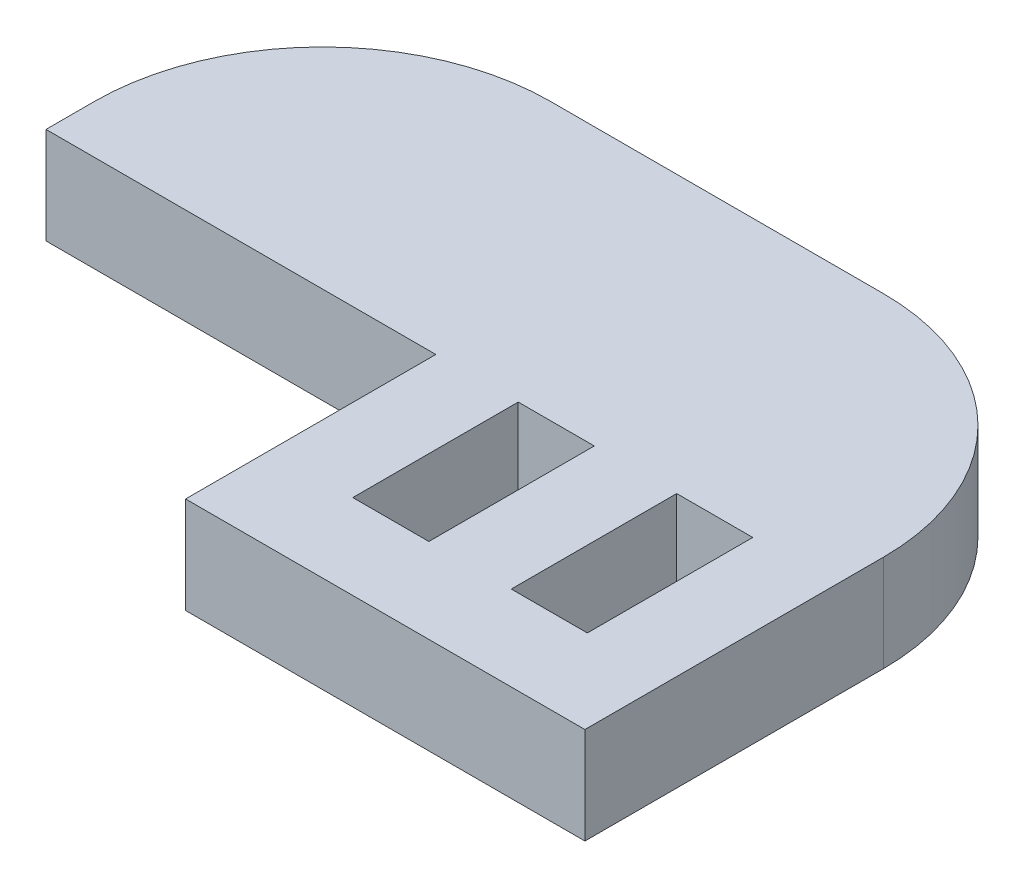
ISO-10303-21;
HEADER;
FILE_DESCRIPTION(('STEP AP214'),'2;1');
FILE_NAME('part.step','',(''),(''),'','','');
FILE_SCHEMA(('AUTOMOTIVE_DESIGN { 1 0 10303 214 1 1 1 1 }'));
ENDSEC;
DATA;
#1=APPLICATION_CONTEXT('core data for automotive mechanical design processes');
#2=APPLICATION_PROTOCOL_DEFINITION('international standard','automotive_design',2000,#1);
#3=PRODUCT_CONTEXT('',#1,'mechanical');
#4=PRODUCT('Part','Part','',(#3));
#5=PRODUCT_RELATED_PRODUCT_CATEGORY('part','',(#4));
#6=PRODUCT_DEFINITION_FORMATION('','',#4);
#7=PRODUCT_DEFINITION_CONTEXT('part definition',#1,'design');
#8=PRODUCT_DEFINITION('design','',#6,#7);
#9=PRODUCT_DEFINITION_SHAPE('','',#8);
#10=(LENGTH_UNIT() NAMED_UNIT(*) SI_UNIT(.MILLI.,.METRE.));
#11=(NAMED_UNIT(*) PLANE_ANGLE_UNIT() SI_UNIT($,.RADIAN.));
#12=(NAMED_UNIT(*) SI_UNIT($,.STERADIAN.) SOLID_ANGLE_UNIT());
#13=UNCERTAINTY_MEASURE_WITH_UNIT(LENGTH_MEASURE(1.E-05),#10,'distance_accuracy_value','');
#14=(GEOMETRIC_REPRESENTATION_CONTEXT(3) GLOBAL_UNCERTAINTY_ASSIGNED_CONTEXT((#13)) GLOBAL_UNIT_ASSIGNED_CONTEXT((#10,
#11,#12)) REPRESENTATION_CONTEXT('',''));
#15=CARTESIAN_POINT('',(0.,0.,0.));
#16=DIRECTION('',(0.,0.,1.));
#17=DIRECTION('',(1.,0.,0.));
#18=AXIS2_PLACEMENT_3D('',#15,#16,#17);
#19=CARTESIAN_POINT('',(-79.2951479286863,-6.6341717794154,17.0848492648442));
#20=DIRECTION('',(1.,0.,0.));
#21=DIRECTION('',(0.,0.,-1.));
#22=AXIS2_PLACEMENT_3D('',#19,#20,#21);
#23=PLANE('',#22);
#24=DIRECTION('',(0.,0.,1.));
#25=VECTOR('',#24,1.);
#26=CARTESIAN_POINT('',(-79.2951479286863,-6.6341717794154,17.0848492648442));
#27=LINE('',#26,#25);
#28=CARTESIAN_POINT('',(-79.2951479286863,-6.6341717794154,4.3848492648442));
#29=VERTEX_POINT('',#28);
#30=CARTESIAN_POINT('',(-79.2951479286863,-6.6341717794154,6.92484926484419));
#31=VERTEX_POINT('',#30);
#32=EDGE_CURVE('E255',#29,#31,#27,.T.);
#33=ORIENTED_EDGE('',*,*,#32,.F.);
#34=DIRECTION('',(0.,1.,0.));
#35=VECTOR('',#34,1.);
#36=CARTESIAN_POINT('',(-79.2951479286863,-6.6341717794154,4.3848492648442));
#37=LINE('',#36,#35);
#38=CARTESIAN_POINT('',(-79.2951479286863,-11.7141717794154,4.3848492648442));
#39=VERTEX_POINT('',#38);
#40=EDGE_CURVE('E11',#29,#39,#37,.F.);
#41=ORIENTED_EDGE('',*,*,#40,.T.);
#42=DIRECTION('',(0.,0.,1.));
#43=VECTOR('',#42,1.);
#44=CARTESIAN_POINT('',(-79.2951479286863,-11.7141717794154,17.0848492648442));
#45=LINE('',#44,#43);
#46=CARTESIAN_POINT('',(-79.2951479286863,-11.7141717794154,6.92484926484419));
#47=VERTEX_POINT('',#46);
#48=EDGE_CURVE('E251',#39,#47,#45,.T.);
#49=ORIENTED_EDGE('',*,*,#48,.T.);
#50=DIRECTION('',(0.,-1.,0.));
#51=VECTOR('',#50,1.);
#52=CARTESIAN_POINT('',(-79.2951479286863,-11.7141717794154,6.92484926484419));
#53=LINE('',#52,#51);
#54=EDGE_CURVE('E235',#31,#47,#53,.T.);
#55=ORIENTED_EDGE('',*,*,#54,.F.);
#56=EDGE_LOOP('',(#33,#41,#49,#55));
#57=FACE_BOUND('',#56,.T.);
#58=ADVANCED_FACE('F35',(#57),#23,.F.);
#59=CARTESIAN_POINT('',(-17.2951479286863,-6.6341717794154,17.0848492648442));
#60=DIRECTION('',(0.,1.,0.));
#61=DIRECTION('',(0.,0.,1.));
#62=AXIS2_PLACEMENT_3D('',#59,#60,#61);
#63=PLANE('',#62);
#64=DIRECTION('',(0.,0.,1.));
#65=VECTOR('',#64,1.);
#66=CARTESIAN_POINT('',(-54.4618145953529,-6.6341717794154,6.92484926484419));
#67=LINE('',#66,#65);
#68=CARTESIAN_POINT('',(-54.4618145953529,-6.6341717794154,6.92484926484419));
#69=VERTEX_POINT('',#68);
#70=CARTESIAN_POINT('',(-54.4618145953529,-6.6341717794154,15.6248492648442));
#71=VERTEX_POINT('',#70);
#72=EDGE_CURVE('E50',#69,#71,#67,.T.);
#73=ORIENTED_EDGE('',*,*,#72,.F.);
#74=DIRECTION('',(-1.,0.,0.));
#75=VECTOR('',#74,1.);
#76=CARTESIAN_POINT('',(-50.4618145953529,-6.6341717794154,6.92484926484419));
#77=LINE('',#76,#75);
#78=CARTESIAN_POINT('',(-50.4618145953529,-6.6341717794154,6.92484926484419));
#79=VERTEX_POINT('',#78);
#80=EDGE_CURVE('E168',#79,#69,#77,.T.);
#81=ORIENTED_EDGE('',*,*,#80,.F.);
#82=DIRECTION('',(0.,0.,-1.));
#83=VECTOR('',#82,1.);
#84=CARTESIAN_POINT('',(-50.4618145953529,-6.6341717794154,6.92484926484419));
#85=LINE('',#84,#83);
#86=CARTESIAN_POINT('',(-50.4618145953529,-6.6341717794154,15.6248492648442));
#87=VERTEX_POINT('',#86);
#88=EDGE_CURVE('E171',#87,#79,#85,.T.);
#89=ORIENTED_EDGE('',*,*,#88,.F.);
#90=DIRECTION('',(1.,0.,0.));
#91=VECTOR('',#90,1.);
#92=CARTESIAN_POINT('',(-50.4618145953529,-6.6341717794154,15.6248492648442));
#93=LINE('',#92,#91);
#94=EDGE_CURVE('E177',#71,#87,#93,.T.);
#95=ORIENTED_EDGE('',*,*,#94,.F.);
#96=EDGE_LOOP('',(#73,#81,#89,#95));
#97=FACE_BOUND('',#96,.T.);
#98=DIRECTION('',(0.,0.,-1.));
#99=VECTOR('',#98,1.);
#100=CARTESIAN_POINT('',(-42.1284812620196,-6.6341717794154,6.92484926484419));
#101=LINE('',#100,#99);
#102=CARTESIAN_POINT('',(-42.1284812620196,-6.6341717794154,15.6248492648442));
#103=VERTEX_POINT('',#102);
#104=CARTESIAN_POINT('',(-42.1284812620196,-6.6341717794154,6.92484926484419));
#105=VERTEX_POINT('',#104);
#106=EDGE_CURVE('E58',#103,#105,#101,.T.);
#107=ORIENTED_EDGE('',*,*,#106,.F.);
#108=DIRECTION('',(1.,0.,0.));
#109=VECTOR('',#108,1.);
#110=CARTESIAN_POINT('',(-42.1284812620196,-6.6341717794154,15.6248492648442));
#111=LINE('',#110,#109);
#112=CARTESIAN_POINT('',(-46.1284812620196,-6.6341717794154,15.6248492648442));
#113=VERTEX_POINT('',#112);
#114=EDGE_CURVE('E192',#113,#103,#111,.T.);
#115=ORIENTED_EDGE('',*,*,#114,.F.);
#116=DIRECTION('',(0.,0.,1.));
#117=VECTOR('',#116,1.);
#118=CARTESIAN_POINT('',(-46.1284812620196,-6.6341717794154,6.92484926484419));
#119=LINE('',#118,#117);
#120=CARTESIAN_POINT('',(-46.1284812620196,-6.6341717794154,6.92484926484419));
#121=VERTEX_POINT('',#120);
#122=EDGE_CURVE('E206',#121,#113,#119,.T.);
#123=ORIENTED_EDGE('',*,*,#122,.F.);
#124=DIRECTION('',(-1.,0.,0.));
#125=VECTOR('',#124,1.);
#126=CARTESIAN_POINT('',(-42.1284812620196,-6.6341717794154,6.92484926484419));
#127=LINE('',#126,#125);
#128=EDGE_CURVE('E203',#105,#121,#127,.T.);
#129=ORIENTED_EDGE('',*,*,#128,.F.);
#130=EDGE_LOOP('',(#107,#115,#123,#129));
#131=FACE_BOUND('',#130,.T.);
#132=DIRECTION('',(0.,0.,1.));
#133=VECTOR('',#132,1.);
#134=CARTESIAN_POINT('',(-37.7951479286863,-6.6341717794154,6.92484926484419));
#135=LINE('',#134,#133);
#136=CARTESIAN_POINT('',(-37.7951479286863,-6.6341717794154,4.3848492648442));
#137=VERTEX_POINT('',#136);
#138=CARTESIAN_POINT('',(-37.7951479286863,-6.6341717794154,20.0848492648442));
#139=VERTEX_POINT('',#138);
#140=EDGE_CURVE('E239',#137,#139,#135,.T.);
#141=ORIENTED_EDGE('',*,*,#140,.F.);
#142=CARTESIAN_POINT('',(-49.7951479286863,-6.6341717794154,4.3848492648442));
#143=DIRECTION('',(0.,1.,0.));
#144=DIRECTION('',(0.,0.,1.));
#145=AXIS2_PLACEMENT_3D('',#142,#143,#144);
#146=CIRCLE('',#145,12.);
#147=CARTESIAN_POINT('',(-49.7951479286863,-6.6341717794154,-7.6151507351558));
#148=VERTEX_POINT('',#147);
#149=EDGE_CURVE('E43',#137,#148,#146,.T.);
#150=ORIENTED_EDGE('',*,*,#149,.T.);
#151=DIRECTION('',(1.,0.,0.));
#152=VECTOR('',#151,1.);
#153=CARTESIAN_POINT('',(-79.2951479286863,-6.6341717794154,-7.6151507351558));
#154=LINE('',#153,#152);
#155=CARTESIAN_POINT('',(-67.2951479286863,-6.6341717794154,-7.6151507351558));
#156=VERTEX_POINT('',#155);
#157=EDGE_CURVE('E184',#156,#148,#154,.T.);
#158=ORIENTED_EDGE('',*,*,#157,.F.);
#159=CARTESIAN_POINT('',(-67.2951479286863,-6.6341717794154,4.3848492648442));
#160=DIRECTION('',(0.,1.,0.));
#161=DIRECTION('',(0.,0.,1.));
#162=AXIS2_PLACEMENT_3D('',#159,#160,#161);
#163=CIRCLE('',#162,12.);
#164=EDGE_CURVE('E270',#156,#29,#163,.T.);
#165=ORIENTED_EDGE('',*,*,#164,.T.);
#166=ORIENTED_EDGE('',*,*,#32,.T.);
#167=DIRECTION('',(-1.,0.,0.));
#168=VECTOR('',#167,1.);
#169=CARTESIAN_POINT('',(-79.2951479286863,-6.6341717794154,6.92484926484419));
#170=LINE('',#169,#168);
#171=CARTESIAN_POINT('',(-58.7951479286863,-6.6341717794154,6.92484926484419));
#172=VERTEX_POINT('',#171);
#173=EDGE_CURVE('E245',#172,#31,#170,.T.);
#174=ORIENTED_EDGE('',*,*,#173,.F.);
#175=DIRECTION('',(0.,0.,1.));
#176=VECTOR('',#175,1.);
#177=CARTESIAN_POINT('',(-58.7951479286863,-6.6341717794154,6.92484926484419));
#178=LINE('',#177,#176);
#179=CARTESIAN_POINT('',(-58.7951479286863,-6.6341717794154,20.0848492648442));
#180=VERTEX_POINT('',#179);
#181=EDGE_CURVE('E249',#172,#180,#178,.T.);
#182=ORIENTED_EDGE('',*,*,#181,.T.);
#183=DIRECTION('',(-1.,0.,0.));
#184=VECTOR('',#183,1.);
#185=CARTESIAN_POINT('',(-58.7951479286863,-6.6341717794154,20.0848492648442));
#186=LINE('',#185,#184);
#187=EDGE_CURVE('E231',#139,#180,#186,.T.);
#188=ORIENTED_EDGE('',*,*,#187,.F.);
#189=EDGE_LOOP('',(#141,#150,#158,#165,#166,#174,#182,#188));
#190=FACE_BOUND('',#189,.T.);
#191=ADVANCED_FACE('F275',(#97,#131,#190),#63,.T.);
#192=CARTESIAN_POINT('',(-17.2951479286863,-11.7141717794154,17.0848492648442));
#193=DIRECTION('',(0.,1.,0.));
#194=DIRECTION('',(0.,0.,1.));
#195=AXIS2_PLACEMENT_3D('',#192,#193,#194);
#196=PLANE('',#195);
#197=DIRECTION('',(-1.,0.,0.));
#198=VECTOR('',#197,1.);
#199=CARTESIAN_POINT('',(-50.4618145953529,-11.7141717794154,6.92484926484419));
#200=LINE('',#199,#198);
#201=CARTESIAN_POINT('',(-50.4618145953529,-11.7141717794154,6.92484926484419));
#202=VERTEX_POINT('',#201);
#203=CARTESIAN_POINT('',(-54.4618145953529,-11.7141717794154,6.92484926484419));
#204=VERTEX_POINT('',#203);
#205=EDGE_CURVE('E155',#202,#204,#200,.T.);
#206=ORIENTED_EDGE('',*,*,#205,.T.);
#207=DIRECTION('',(0.,0.,1.));
#208=VECTOR('',#207,1.);
#209=CARTESIAN_POINT('',(-54.4618145953529,-11.7141717794154,6.92484926484419));
#210=LINE('',#209,#208);
#211=CARTESIAN_POINT('',(-54.4618145953529,-11.7141717794154,15.6248492648442));
#212=VERTEX_POINT('',#211);
#213=EDGE_CURVE('E149',#204,#212,#210,.T.);
#214=ORIENTED_EDGE('',*,*,#213,.T.);
#215=DIRECTION('',(1.,0.,0.));
#216=VECTOR('',#215,1.);
#217=CARTESIAN_POINT('',(-50.4618145953529,-11.7141717794154,15.6248492648442));
#218=LINE('',#217,#216);
#219=CARTESIAN_POINT('',(-50.4618145953529,-11.7141717794154,15.6248492648442));
#220=VERTEX_POINT('',#219);
#221=EDGE_CURVE('E159',#212,#220,#218,.T.);
#222=ORIENTED_EDGE('',*,*,#221,.T.);
#223=DIRECTION('',(0.,0.,-1.));
#224=VECTOR('',#223,1.);
#225=CARTESIAN_POINT('',(-50.4618145953529,-11.7141717794154,6.92484926484419));
#226=LINE('',#225,#224);
#227=EDGE_CURVE('E163',#220,#202,#226,.T.);
#228=ORIENTED_EDGE('',*,*,#227,.T.);
#229=EDGE_LOOP('',(#206,#214,#222,#228));
#230=FACE_BOUND('',#229,.T.);
#231=DIRECTION('',(1.,0.,0.));
#232=VECTOR('',#231,1.);
#233=CARTESIAN_POINT('',(-42.1284812620196,-11.7141717794154,15.6248492648442));
#234=LINE('',#233,#232);
#235=CARTESIAN_POINT('',(-46.1284812620196,-11.7141717794154,15.6248492648442));
#236=VERTEX_POINT('',#235);
#237=CARTESIAN_POINT('',(-42.1284812620196,-11.7141717794154,15.6248492648442));
#238=VERTEX_POINT('',#237);
#239=EDGE_CURVE('E198',#236,#238,#234,.T.);
#240=ORIENTED_EDGE('',*,*,#239,.T.);
#241=DIRECTION('',(0.,0.,-1.));
#242=VECTOR('',#241,1.);
#243=CARTESIAN_POINT('',(-42.1284812620196,-11.7141717794154,6.92484926484419));
#244=LINE('',#243,#242);
#245=CARTESIAN_POINT('',(-42.1284812620196,-11.7141717794154,6.92484926484419));
#246=VERTEX_POINT('',#245);
#247=EDGE_CURVE('E188',#238,#246,#244,.T.);
#248=ORIENTED_EDGE('',*,*,#247,.T.);
#249=DIRECTION('',(-1.,0.,0.));
#250=VECTOR('',#249,1.);
#251=CARTESIAN_POINT('',(-42.1284812620196,-11.7141717794154,6.92484926484419));
#252=LINE('',#251,#250);
#253=CARTESIAN_POINT('',(-46.1284812620196,-11.7141717794154,6.92484926484419));
#254=VERTEX_POINT('',#253);
#255=EDGE_CURVE('E191',#246,#254,#252,.T.);
#256=ORIENTED_EDGE('',*,*,#255,.T.);
#257=DIRECTION('',(0.,0.,1.));
#258=VECTOR('',#257,1.);
#259=CARTESIAN_POINT('',(-46.1284812620196,-11.7141717794154,6.92484926484419));
#260=LINE('',#259,#258);
#261=EDGE_CURVE('E195',#254,#236,#260,.T.);
#262=ORIENTED_EDGE('',*,*,#261,.T.);
#263=EDGE_LOOP('',(#240,#248,#256,#262));
#264=FACE_BOUND('',#263,.T.);
#265=DIRECTION('',(-1.,0.,0.));
#266=VECTOR('',#265,1.);
#267=CARTESIAN_POINT('',(-79.2951479286863,-11.7141717794154,-7.6151507351558));
#268=LINE('',#267,#266);
#269=CARTESIAN_POINT('',(-49.7951479286863,-11.7141717794154,-7.6151507351558));
#270=VERTEX_POINT('',#269);
#271=CARTESIAN_POINT('',(-67.2951479286863,-11.7141717794154,-7.6151507351558));
#272=VERTEX_POINT('',#271);
#273=EDGE_CURVE('E219',#270,#272,#268,.T.);
#274=ORIENTED_EDGE('',*,*,#273,.F.);
#275=CARTESIAN_POINT('',(-49.7951479286863,-11.7141717794154,4.3848492648442));
#276=DIRECTION('',(0.,1.,0.));
#277=DIRECTION('',(0.,0.,1.));
#278=AXIS2_PLACEMENT_3D('',#275,#276,#277);
#279=CIRCLE('',#278,12.);
#280=CARTESIAN_POINT('',(-37.7951479286863,-11.7141717794154,4.3848492648442));
#281=VERTEX_POINT('',#280);
#282=EDGE_CURVE('E266',#270,#281,#279,.F.);
#283=ORIENTED_EDGE('',*,*,#282,.T.);
#284=DIRECTION('',(0.,0.,1.));
#285=VECTOR('',#284,1.);
#286=CARTESIAN_POINT('',(-37.7951479286863,-11.7141717794154,6.92484926484419));
#287=LINE('',#286,#285);
#288=CARTESIAN_POINT('',(-37.7951479286863,-11.7141717794154,20.0848492648442));
#289=VERTEX_POINT('',#288);
#290=EDGE_CURVE('E234',#281,#289,#287,.T.);
#291=ORIENTED_EDGE('',*,*,#290,.T.);
#292=DIRECTION('',(1.,0.,0.));
#293=VECTOR('',#292,1.);
#294=CARTESIAN_POINT('',(-58.7951479286863,-11.7141717794154,20.0848492648442));
#295=LINE('',#294,#293);
#296=CARTESIAN_POINT('',(-58.7951479286863,-11.7141717794154,20.0848492648442));
#297=VERTEX_POINT('',#296);
#298=EDGE_CURVE('E225',#297,#289,#295,.T.);
#299=ORIENTED_EDGE('',*,*,#298,.F.);
#300=DIRECTION('',(0.,0.,1.));
#301=VECTOR('',#300,1.);
#302=CARTESIAN_POINT('',(-58.7951479286863,-11.7141717794154,6.92484926484419));
#303=LINE('',#302,#301);
#304=CARTESIAN_POINT('',(-58.7951479286863,-11.7141717794154,6.92484926484419));
#305=VERTEX_POINT('',#304);
#306=EDGE_CURVE('E248',#305,#297,#303,.T.);
#307=ORIENTED_EDGE('',*,*,#306,.F.);
#308=DIRECTION('',(1.,0.,0.));
#309=VECTOR('',#308,1.);
#310=CARTESIAN_POINT('',(-79.2951479286863,-11.7141717794154,6.92484926484419));
#311=LINE('',#310,#309);
#312=EDGE_CURVE('E238',#47,#305,#311,.T.);
#313=ORIENTED_EDGE('',*,*,#312,.F.);
#314=ORIENTED_EDGE('',*,*,#48,.F.);
#315=CARTESIAN_POINT('',(-67.2951479286863,-11.7141717794154,4.3848492648442));
#316=DIRECTION('',(0.,1.,0.));
#317=DIRECTION('',(0.,0.,1.));
#318=AXIS2_PLACEMENT_3D('',#315,#316,#317);
#319=CIRCLE('',#318,12.);
#320=EDGE_CURVE('E264',#39,#272,#319,.F.);
#321=ORIENTED_EDGE('',*,*,#320,.T.);
#322=EDGE_LOOP('',(#274,#283,#291,#299,#307,#313,#314,#321));
#323=FACE_BOUND('',#322,.T.);
#324=ADVANCED_FACE('F165',(#230,#264,#323),#196,.F.);
#325=CARTESIAN_POINT('',(-37.7951479286863,-11.7141717794154,6.92484926484419));
#326=DIRECTION('',(-1.,0.,0.));
#327=DIRECTION('',(0.,0.,1.));
#328=AXIS2_PLACEMENT_3D('',#325,#326,#327);
#329=PLANE('',#328);
#330=ORIENTED_EDGE('',*,*,#290,.F.);
#331=DIRECTION('',(0.,-1.,0.));
#332=VECTOR('',#331,1.);
#333=CARTESIAN_POINT('',(-37.7951479286863,-11.7141717794154,4.3848492648442));
#334=LINE('',#333,#332);
#335=EDGE_CURVE('E268',#281,#137,#334,.F.);
#336=ORIENTED_EDGE('',*,*,#335,.T.);
#337=ORIENTED_EDGE('',*,*,#140,.T.);
#338=DIRECTION('',(0.,1.,0.));
#339=VECTOR('',#338,1.);
#340=CARTESIAN_POINT('',(-37.7951479286863,-6.6341717794154,20.0848492648442));
#341=LINE('',#340,#339);
#342=EDGE_CURVE('E228',#289,#139,#341,.T.);
#343=ORIENTED_EDGE('',*,*,#342,.F.);
#344=EDGE_LOOP('',(#330,#336,#337,#343));
#345=FACE_BOUND('',#344,.T.);
#346=ADVANCED_FACE('F290',(#345),#329,.F.);
#347=CARTESIAN_POINT('',(-58.7951479286863,-11.7141717794154,6.92484926484419));
#348=DIRECTION('',(1.,0.,0.));
#349=DIRECTION('',(0.,0.,-1.));
#350=AXIS2_PLACEMENT_3D('',#347,#348,#349);
#351=PLANE('',#350);
#352=ORIENTED_EDGE('',*,*,#306,.T.);
#353=DIRECTION('',(0.,-1.,0.));
#354=VECTOR('',#353,1.);
#355=CARTESIAN_POINT('',(-58.7951479286863,-6.6341717794154,20.0848492648442));
#356=LINE('',#355,#354);
#357=EDGE_CURVE('E222',#180,#297,#356,.T.);
#358=ORIENTED_EDGE('',*,*,#357,.F.);
#359=ORIENTED_EDGE('',*,*,#181,.F.);
#360=DIRECTION('',(0.,1.,0.));
#361=VECTOR('',#360,1.);
#362=CARTESIAN_POINT('',(-58.7951479286863,-11.7141717794154,6.92484926484419));
#363=LINE('',#362,#361);
#364=EDGE_CURVE('E242',#305,#172,#363,.T.);
#365=ORIENTED_EDGE('',*,*,#364,.F.);
#366=EDGE_LOOP('',(#352,#358,#359,#365));
#367=FACE_BOUND('',#366,.T.);
#368=ADVANCED_FACE('F296',(#367),#351,.F.);
#369=CARTESIAN_POINT('',(-17.2951479286863,-11.7141717794154,6.92484926484419));
#370=DIRECTION('',(0.,0.,-1.));
#371=DIRECTION('',(-1.,0.,0.));
#372=AXIS2_PLACEMENT_3D('',#369,#370,#371);
#373=PLANE('',#372);
#374=ORIENTED_EDGE('',*,*,#54,.T.);
#375=ORIENTED_EDGE('',*,*,#312,.T.);
#376=ORIENTED_EDGE('',*,*,#364,.T.);
#377=ORIENTED_EDGE('',*,*,#173,.T.);
#378=EDGE_LOOP('',(#374,#375,#376,#377));
#379=FACE_BOUND('',#378,.T.);
#380=ADVANCED_FACE('F298',(#379),#373,.F.);
#381=CARTESIAN_POINT('',(0.,0.,20.0848492648442));
#382=DIRECTION('',(0.,0.,1.));
#383=DIRECTION('',(1.,0.,0.));
#384=AXIS2_PLACEMENT_3D('',#381,#382,#383);
#385=PLANE('',#384);
#386=ORIENTED_EDGE('',*,*,#357,.T.);
#387=ORIENTED_EDGE('',*,*,#298,.T.);
#388=ORIENTED_EDGE('',*,*,#342,.T.);
#389=ORIENTED_EDGE('',*,*,#187,.T.);
#390=EDGE_LOOP('',(#386,#387,#388,#389));
#391=FACE_BOUND('',#390,.T.);
#392=ADVANCED_FACE('F292',(#391),#385,.T.);
#393=CARTESIAN_POINT('',(0.,0.,-7.61515073515581));
#394=DIRECTION('',(0.,0.,1.));
#395=DIRECTION('',(1.,0.,0.));
#396=AXIS2_PLACEMENT_3D('',#393,#394,#395);
#397=PLANE('',#396);
#398=ORIENTED_EDGE('',*,*,#157,.T.);
#399=DIRECTION('',(0.,-1.,0.));
#400=VECTOR('',#399,1.);
#401=CARTESIAN_POINT('',(-49.7951479286863,0.,-7.6151507351558));
#402=LINE('',#401,#400);
#403=EDGE_CURVE('E261',#148,#270,#402,.T.);
#404=ORIENTED_EDGE('',*,*,#403,.T.);
#405=ORIENTED_EDGE('',*,*,#273,.T.);
#406=DIRECTION('',(0.,1.,0.));
#407=VECTOR('',#406,1.);
#408=CARTESIAN_POINT('',(-67.2951479286863,0.,-7.6151507351558));
#409=LINE('',#408,#407);
#410=EDGE_CURVE('E257',#272,#156,#409,.T.);
#411=ORIENTED_EDGE('',*,*,#410,.T.);
#412=EDGE_LOOP('',(#398,#404,#405,#411));
#413=FACE_BOUND('',#412,.T.);
#414=ADVANCED_FACE('F281',(#413),#397,.F.);
#415=CARTESIAN_POINT('',(-49.7951479286863,0.,4.3848492648442));
#416=DIRECTION('',(0.,-1.,0.));
#417=DIRECTION('',(0.,0.,-1.));
#418=AXIS2_PLACEMENT_3D('',#415,#416,#417);
#419=CYLINDRICAL_SURFACE('',#418,12.);
#420=ORIENTED_EDGE('',*,*,#149,.F.);
#421=ORIENTED_EDGE('',*,*,#335,.F.);
#422=ORIENTED_EDGE('',*,*,#282,.F.);
#423=ORIENTED_EDGE('',*,*,#403,.F.);
#424=EDGE_LOOP('',(#420,#421,#422,#423));
#425=FACE_BOUND('',#424,.T.);
#426=ADVANCED_FACE('F284',(#425),#419,.T.);
#427=CARTESIAN_POINT('',(-67.2951479286863,0.,4.3848492648442));
#428=DIRECTION('',(0.,1.,0.));
#429=DIRECTION('',(0.,0.,1.));
#430=AXIS2_PLACEMENT_3D('',#427,#428,#429);
#431=CYLINDRICAL_SURFACE('',#430,12.);
#432=ORIENTED_EDGE('',*,*,#320,.F.);
#433=ORIENTED_EDGE('',*,*,#40,.F.);
#434=ORIENTED_EDGE('',*,*,#164,.F.);
#435=ORIENTED_EDGE('',*,*,#410,.F.);
#436=EDGE_LOOP('',(#432,#433,#434,#435));
#437=FACE_BOUND('',#436,.T.);
#438=ADVANCED_FACE('F37',(#437),#431,.T.);
#439=CARTESIAN_POINT('',(-42.1284812620196,-11.7141717794154,6.92484926484419));
#440=DIRECTION('',(1.,0.,0.));
#441=DIRECTION('',(0.,0.,-1.));
#442=AXIS2_PLACEMENT_3D('',#439,#440,#441);
#443=PLANE('',#442);
#444=ORIENTED_EDGE('',*,*,#106,.T.);
#445=DIRECTION('',(0.,1.,0.));
#446=VECTOR('',#445,1.);
#447=CARTESIAN_POINT('',(-42.1284812620196,-11.7141717794154,6.92484926484419));
#448=LINE('',#447,#446);
#449=EDGE_CURVE('E201',#246,#105,#448,.T.);
#450=ORIENTED_EDGE('',*,*,#449,.F.);
#451=ORIENTED_EDGE('',*,*,#247,.F.);
#452=DIRECTION('',(0.,1.,0.));
#453=VECTOR('',#452,1.);
#454=CARTESIAN_POINT('',(-42.1284812620196,-11.7141717794154,15.6248492648442));
#455=LINE('',#454,#453);
#456=EDGE_CURVE('E178',#238,#103,#455,.T.);
#457=ORIENTED_EDGE('',*,*,#456,.T.);
#458=EDGE_LOOP('',(#444,#450,#451,#457));
#459=FACE_BOUND('',#458,.T.);
#460=ADVANCED_FACE('F321',(#459),#443,.F.);
#461=CARTESIAN_POINT('',(-42.1284812620196,-11.7141717794154,15.6248492648442));
#462=DIRECTION('',(0.,0.,1.));
#463=DIRECTION('',(1.,0.,0.));
#464=AXIS2_PLACEMENT_3D('',#461,#462,#463);
#465=PLANE('',#464);
#466=ORIENTED_EDGE('',*,*,#114,.T.);
#467=ORIENTED_EDGE('',*,*,#456,.F.);
#468=ORIENTED_EDGE('',*,*,#239,.F.);
#469=DIRECTION('',(0.,1.,0.));
#470=VECTOR('',#469,1.);
#471=CARTESIAN_POINT('',(-46.1284812620196,-11.7141717794154,15.6248492648442));
#472=LINE('',#471,#470);
#473=EDGE_CURVE('E212',#236,#113,#472,.T.);
#474=ORIENTED_EDGE('',*,*,#473,.T.);
#475=EDGE_LOOP('',(#466,#467,#468,#474));
#476=FACE_BOUND('',#475,.T.);
#477=ADVANCED_FACE('F422',(#476),#465,.F.);
#478=CARTESIAN_POINT('',(-46.1284812620196,-11.7141717794154,6.92484926484419));
#479=DIRECTION('',(-1.,0.,0.));
#480=DIRECTION('',(0.,0.,1.));
#481=AXIS2_PLACEMENT_3D('',#478,#479,#480);
#482=PLANE('',#481);
#483=ORIENTED_EDGE('',*,*,#122,.T.);
#484=ORIENTED_EDGE('',*,*,#473,.F.);
#485=ORIENTED_EDGE('',*,*,#261,.F.);
#486=DIRECTION('',(0.,1.,0.));
#487=VECTOR('',#486,1.);
#488=CARTESIAN_POINT('',(-46.1284812620196,-11.7141717794154,6.92484926484419));
#489=LINE('',#488,#487);
#490=EDGE_CURVE('E214',#254,#121,#489,.T.);
#491=ORIENTED_EDGE('',*,*,#490,.T.);
#492=EDGE_LOOP('',(#483,#484,#485,#491));
#493=FACE_BOUND('',#492,.T.);
#494=ADVANCED_FACE('F427',(#493),#482,.F.);
#495=CARTESIAN_POINT('',(-42.1284812620196,-11.7141717794154,6.92484926484419));
#496=DIRECTION('',(0.,0.,-1.));
#497=DIRECTION('',(-1.,0.,0.));
#498=AXIS2_PLACEMENT_3D('',#495,#496,#497);
#499=PLANE('',#498);
#500=ORIENTED_EDGE('',*,*,#128,.T.);
#501=ORIENTED_EDGE('',*,*,#490,.F.);
#502=ORIENTED_EDGE('',*,*,#255,.F.);
#503=ORIENTED_EDGE('',*,*,#449,.T.);
#504=EDGE_LOOP('',(#500,#501,#502,#503));
#505=FACE_BOUND('',#504,.T.);
#506=ADVANCED_FACE('F435',(#505),#499,.F.);
#507=CARTESIAN_POINT('',(-54.4618145953529,-11.7141717794154,6.92484926484419));
#508=DIRECTION('',(-1.,0.,0.));
#509=DIRECTION('',(0.,0.,1.));
#510=AXIS2_PLACEMENT_3D('',#507,#508,#509);
#511=PLANE('',#510);
#512=ORIENTED_EDGE('',*,*,#72,.T.);
#513=DIRECTION('',(0.,1.,0.));
#514=VECTOR('',#513,1.);
#515=CARTESIAN_POINT('',(-54.4618145953529,-11.7141717794154,15.6248492648442));
#516=LINE('',#515,#514);
#517=EDGE_CURVE('E145',#212,#71,#516,.T.);
#518=ORIENTED_EDGE('',*,*,#517,.F.);
#519=ORIENTED_EDGE('',*,*,#213,.F.);
#520=DIRECTION('',(0.,1.,0.));
#521=VECTOR('',#520,1.);
#522=CARTESIAN_POINT('',(-54.4618145953529,-11.7141717794154,6.92484926484419));
#523=LINE('',#522,#521);
#524=EDGE_CURVE('E182',#204,#69,#523,.T.);
#525=ORIENTED_EDGE('',*,*,#524,.T.);
#526=EDGE_LOOP('',(#512,#518,#519,#525));
#527=FACE_BOUND('',#526,.T.);
#528=ADVANCED_FACE('F147',(#527),#511,.F.);
#529=CARTESIAN_POINT('',(-50.4618145953529,-11.7141717794154,6.92484926484419));
#530=DIRECTION('',(0.,0.,-1.));
#531=DIRECTION('',(-1.,0.,0.));
#532=AXIS2_PLACEMENT_3D('',#529,#530,#531);
#533=PLANE('',#532);
#534=ORIENTED_EDGE('',*,*,#80,.T.);
#535=ORIENTED_EDGE('',*,*,#524,.F.);
#536=ORIENTED_EDGE('',*,*,#205,.F.);
#537=DIRECTION('',(0.,1.,0.));
#538=VECTOR('',#537,1.);
#539=CARTESIAN_POINT('',(-50.4618145953529,-11.7141717794154,6.92484926484419));
#540=LINE('',#539,#538);
#541=EDGE_CURVE('E185',#202,#79,#540,.T.);
#542=ORIENTED_EDGE('',*,*,#541,.T.);
#543=EDGE_LOOP('',(#534,#535,#536,#542));
#544=FACE_BOUND('',#543,.T.);
#545=ADVANCED_FACE('F449',(#544),#533,.F.);
#546=CARTESIAN_POINT('',(-50.4618145953529,-11.7141717794154,6.92484926484419));
#547=DIRECTION('',(1.,0.,0.));
#548=DIRECTION('',(0.,0.,-1.));
#549=AXIS2_PLACEMENT_3D('',#546,#547,#548);
#550=PLANE('',#549);
#551=ORIENTED_EDGE('',*,*,#88,.T.);
#552=ORIENTED_EDGE('',*,*,#541,.F.);
#553=ORIENTED_EDGE('',*,*,#227,.F.);
#554=DIRECTION('',(0.,1.,0.));
#555=VECTOR('',#554,1.);
#556=CARTESIAN_POINT('',(-50.4618145953529,-11.7141717794154,15.6248492648442));
#557=LINE('',#556,#555);
#558=EDGE_CURVE('E154',#220,#87,#557,.T.);
#559=ORIENTED_EDGE('',*,*,#558,.T.);
#560=EDGE_LOOP('',(#551,#552,#553,#559));
#561=FACE_BOUND('',#560,.T.);
#562=ADVANCED_FACE('F456',(#561),#550,.F.);
#563=CARTESIAN_POINT('',(-50.4618145953529,-11.7141717794154,15.6248492648442));
#564=DIRECTION('',(0.,0.,1.));
#565=DIRECTION('',(1.,0.,0.));
#566=AXIS2_PLACEMENT_3D('',#563,#564,#565);
#567=PLANE('',#566);
#568=ORIENTED_EDGE('',*,*,#94,.T.);
#569=ORIENTED_EDGE('',*,*,#558,.F.);
#570=ORIENTED_EDGE('',*,*,#221,.F.);
#571=ORIENTED_EDGE('',*,*,#517,.T.);
#572=EDGE_LOOP('',(#568,#569,#570,#571));
#573=FACE_BOUND('',#572,.T.);
#574=ADVANCED_FACE('F160',(#573),#567,.F.);
#575=CLOSED_SHELL('',(#58,#191,#324,#346,#368,#380,#392,#414,#426,#438,#460,#477,#494,#506,#528,
#545,#562,#574));
#576=MANIFOLD_SOLID_BREP('B2',#575);
#577=ADVANCED_BREP_SHAPE_REPRESENTATION('',(#18,#576),#14);
#578=SHAPE_DEFINITION_REPRESENTATION(#9,#577);
ENDSEC;
END-ISO-10303-21;
